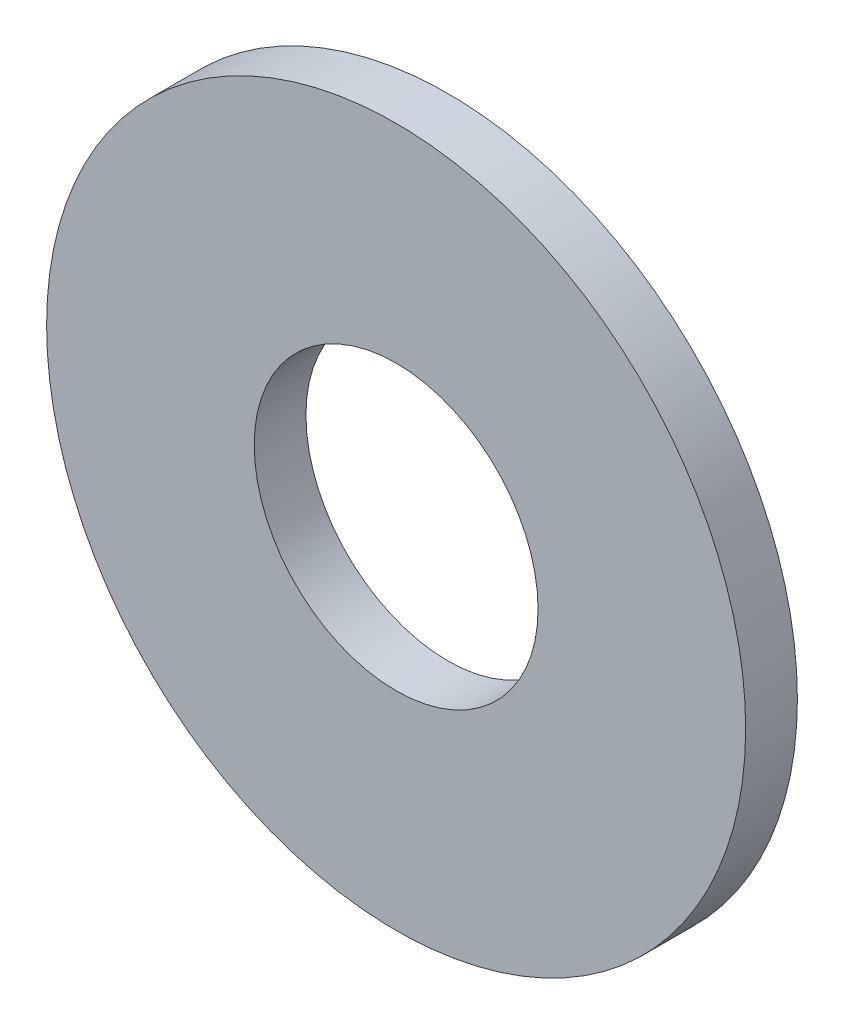
ISO-10303-21;
HEADER;
FILE_DESCRIPTION(('STEP AP214'),'2;1');
FILE_NAME('part.step','',(''),(''),'','','');
FILE_SCHEMA(('AUTOMOTIVE_DESIGN { 1 0 10303 214 1 1 1 1 }'));
ENDSEC;
DATA;
#1=APPLICATION_CONTEXT('core data for automotive mechanical design processes');
#2=APPLICATION_PROTOCOL_DEFINITION('international standard','automotive_design',2000,#1);
#3=PRODUCT_CONTEXT('',#1,'mechanical');
#4=PRODUCT('Part','Part','',(#3));
#5=PRODUCT_RELATED_PRODUCT_CATEGORY('part','',(#4));
#6=PRODUCT_DEFINITION_FORMATION('','',#4);
#7=PRODUCT_DEFINITION_CONTEXT('part definition',#1,'design');
#8=PRODUCT_DEFINITION('design','',#6,#7);
#9=PRODUCT_DEFINITION_SHAPE('','',#8);
#10=(LENGTH_UNIT() NAMED_UNIT(*) SI_UNIT(.MILLI.,.METRE.));
#11=(NAMED_UNIT(*) PLANE_ANGLE_UNIT() SI_UNIT($,.RADIAN.));
#12=(NAMED_UNIT(*) SI_UNIT($,.STERADIAN.) SOLID_ANGLE_UNIT());
#13=UNCERTAINTY_MEASURE_WITH_UNIT(LENGTH_MEASURE(1.E-05),#10,'distance_accuracy_value','');
#14=(GEOMETRIC_REPRESENTATION_CONTEXT(3) GLOBAL_UNCERTAINTY_ASSIGNED_CONTEXT((#13)) GLOBAL_UNIT_ASSIGNED_CONTEXT((#10,
#11,#12)) REPRESENTATION_CONTEXT('',''));
#15=CARTESIAN_POINT('',(0.,0.,0.));
#16=DIRECTION('',(0.,0.,1.));
#17=DIRECTION('',(1.,0.,0.));
#18=AXIS2_PLACEMENT_3D('',#15,#16,#17);
#19=CARTESIAN_POINT('',(0.,0.,34.9249999999999));
#20=DIRECTION('',(0.,0.,1.));
#21=DIRECTION('',(1.,0.,0.));
#22=AXIS2_PLACEMENT_3D('',#19,#20,#21);
#23=CYLINDRICAL_SURFACE('',#22,10.3124);
#24=CARTESIAN_POINT('',(0.,0.,0.));
#25=DIRECTION('',(0.,0.,1.));
#26=DIRECTION('',(1.,0.,0.));
#27=AXIS2_PLACEMENT_3D('',#24,#25,#26);
#28=CIRCLE('',#27,10.3124);
#29=CARTESIAN_POINT('',(10.3124,0.,0.));
#30=VERTEX_POINT('',#29);
#31=EDGE_CURVE('E10',#30,#30,#28,.T.);
#32=ORIENTED_EDGE('',*,*,#31,.F.);
#33=EDGE_LOOP('',(#32));
#34=FACE_BOUND('',#33,.T.);
#35=CARTESIAN_POINT('',(0.,0.,3.7592));
#36=DIRECTION('',(0.,0.,1.));
#37=DIRECTION('',(1.,0.,0.));
#38=AXIS2_PLACEMENT_3D('',#35,#36,#37);
#39=CIRCLE('',#38,10.3124);
#40=CARTESIAN_POINT('',(10.3124,0.,3.7592));
#41=VERTEX_POINT('',#40);
#42=EDGE_CURVE('E46',#41,#41,#39,.T.);
#43=ORIENTED_EDGE('',*,*,#42,.T.);
#44=EDGE_LOOP('',(#43));
#45=FACE_BOUND('',#44,.T.);
#46=ADVANCED_FACE('F32',(#34,#45),#23,.F.);
#47=CARTESIAN_POINT('',(0.,10.3124,0.));
#48=DIRECTION('',(0.,0.,1.));
#49=DIRECTION('',(1.,0.,0.));
#50=AXIS2_PLACEMENT_3D('',#47,#48,#49);
#51=PLANE('',#50);
#52=CARTESIAN_POINT('',(0.,0.,0.));
#53=DIRECTION('',(0.,0.,1.));
#54=DIRECTION('',(1.,0.,0.));
#55=AXIS2_PLACEMENT_3D('',#52,#53,#54);
#56=CIRCLE('',#55,25.4);
#57=CARTESIAN_POINT('',(25.4,0.,0.));
#58=VERTEX_POINT('',#57);
#59=EDGE_CURVE('E38',#58,#58,#56,.T.);
#60=ORIENTED_EDGE('',*,*,#59,.F.);
#61=EDGE_LOOP('',(#60));
#62=FACE_BOUND('',#61,.T.);
#63=ORIENTED_EDGE('',*,*,#31,.T.);
#64=EDGE_LOOP('',(#63));
#65=FACE_BOUND('',#64,.T.);
#66=ADVANCED_FACE('F61',(#62,#65),#51,.F.);
#67=CARTESIAN_POINT('',(0.,0.,34.9249999999999));
#68=DIRECTION('',(0.,0.,1.));
#69=DIRECTION('',(1.,0.,0.));
#70=AXIS2_PLACEMENT_3D('',#67,#68,#69);
#71=CYLINDRICAL_SURFACE('',#70,25.4);
#72=CARTESIAN_POINT('',(0.,0.,3.7592));
#73=DIRECTION('',(0.,0.,1.));
#74=DIRECTION('',(1.,0.,0.));
#75=AXIS2_PLACEMENT_3D('',#72,#73,#74);
#76=CIRCLE('',#75,25.4);
#77=CARTESIAN_POINT('',(25.4,0.,3.7592));
#78=VERTEX_POINT('',#77);
#79=EDGE_CURVE('E42',#78,#78,#76,.T.);
#80=ORIENTED_EDGE('',*,*,#79,.F.);
#81=EDGE_LOOP('',(#80));
#82=FACE_BOUND('',#81,.T.);
#83=ORIENTED_EDGE('',*,*,#59,.T.);
#84=EDGE_LOOP('',(#83));
#85=FACE_BOUND('',#84,.T.);
#86=ADVANCED_FACE('F56',(#82,#85),#71,.T.);
#87=CARTESIAN_POINT('',(0.,25.4,3.7592));
#88=DIRECTION('',(0.,0.,-1.));
#89=DIRECTION('',(-1.,0.,0.));
#90=AXIS2_PLACEMENT_3D('',#87,#88,#89);
#91=PLANE('',#90);
#92=ORIENTED_EDGE('',*,*,#42,.F.);
#93=EDGE_LOOP('',(#92));
#94=FACE_BOUND('',#93,.T.);
#95=ORIENTED_EDGE('',*,*,#79,.T.);
#96=EDGE_LOOP('',(#95));
#97=FACE_BOUND('',#96,.T.);
#98=ADVANCED_FACE('F53',(#94,#97),#91,.F.);
#99=CLOSED_SHELL('',(#46,#66,#86,#98));
#100=MANIFOLD_SOLID_BREP('B2',#99);
#101=ADVANCED_BREP_SHAPE_REPRESENTATION('',(#18,#100),#14);
#102=SHAPE_DEFINITION_REPRESENTATION(#9,#101);
ENDSEC;
END-ISO-10303-21;
